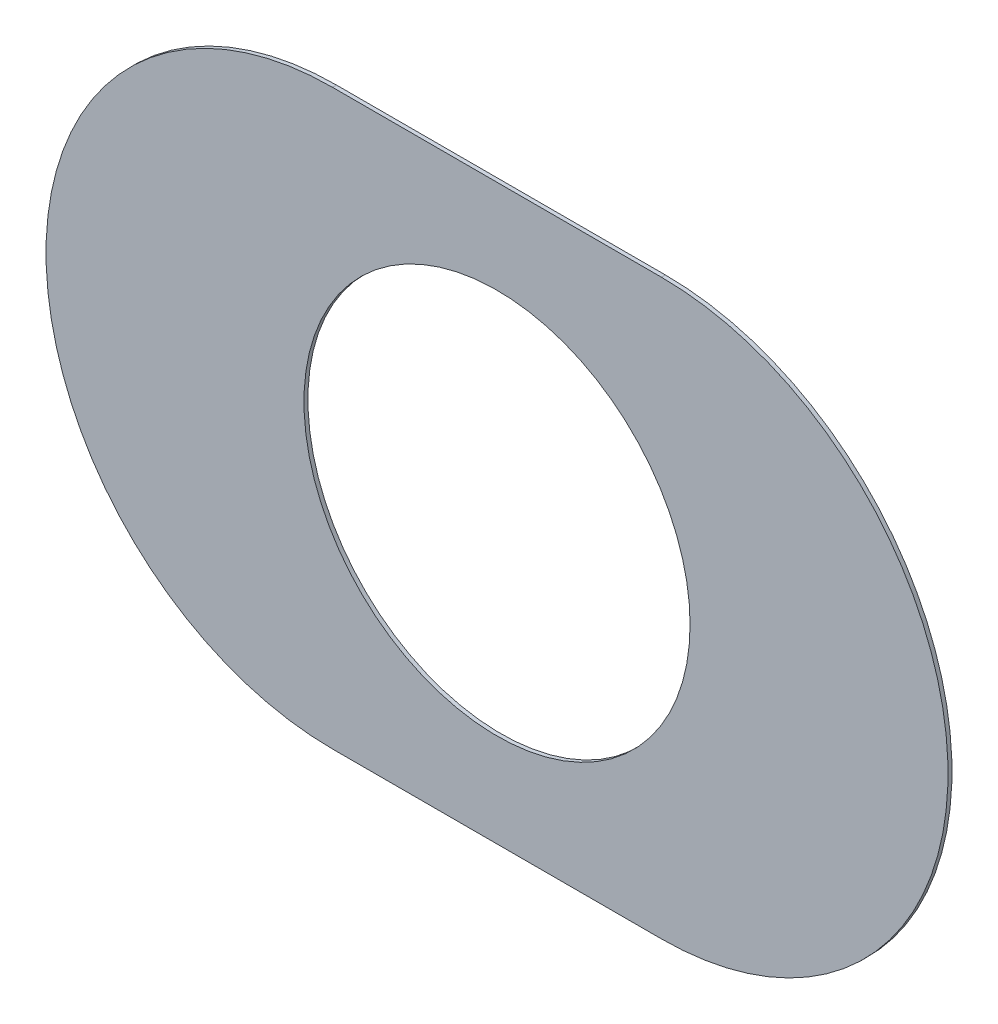
ISO-10303-21;
HEADER;
FILE_DESCRIPTION(('STEP AP214'),'2;1');
FILE_NAME('part.step','',(''),(''),'','','');
FILE_SCHEMA(('AUTOMOTIVE_DESIGN { 1 0 10303 214 1 1 1 1 }'));
ENDSEC;
DATA;
#1=APPLICATION_CONTEXT('core data for automotive mechanical design processes');
#2=APPLICATION_PROTOCOL_DEFINITION('international standard','automotive_design',2000,#1);
#3=PRODUCT_CONTEXT('',#1,'mechanical');
#4=PRODUCT('Part','Part','',(#3));
#5=PRODUCT_RELATED_PRODUCT_CATEGORY('part','',(#4));
#6=PRODUCT_DEFINITION_FORMATION('','',#4);
#7=PRODUCT_DEFINITION_CONTEXT('part definition',#1,'design');
#8=PRODUCT_DEFINITION('design','',#6,#7);
#9=PRODUCT_DEFINITION_SHAPE('','',#8);
#10=(LENGTH_UNIT() NAMED_UNIT(*) SI_UNIT(.MILLI.,.METRE.));
#11=(NAMED_UNIT(*) PLANE_ANGLE_UNIT() SI_UNIT($,.RADIAN.));
#12=(NAMED_UNIT(*) SI_UNIT($,.STERADIAN.) SOLID_ANGLE_UNIT());
#13=UNCERTAINTY_MEASURE_WITH_UNIT(LENGTH_MEASURE(1.E-05),#10,'distance_accuracy_value','');
#14=(GEOMETRIC_REPRESENTATION_CONTEXT(3) GLOBAL_UNCERTAINTY_ASSIGNED_CONTEXT((#13)) GLOBAL_UNIT_ASSIGNED_CONTEXT((#10,
#11,#12)) REPRESENTATION_CONTEXT('',''));
#15=CARTESIAN_POINT('',(0.,0.,0.));
#16=DIRECTION('',(0.,0.,1.));
#17=DIRECTION('',(1.,0.,0.));
#18=AXIS2_PLACEMENT_3D('',#15,#16,#17);
#19=CARTESIAN_POINT('',(24.3000003427268,22.1600006854535,0.));
#20=DIRECTION('',(0.,0.,1.));
#21=DIRECTION('',(1.,0.,0.));
#22=AXIS2_PLACEMENT_3D('',#19,#20,#21);
#23=PLANE('',#22);
#24=CARTESIAN_POINT('',(24.3000003427268,22.1600006854535,0.));
#25=DIRECTION('',(0.,0.,-1.));
#26=DIRECTION('',(-1.,0.,0.));
#27=AXIS2_PLACEMENT_3D('',#24,#25,#26);
#28=CIRCLE('',#27,0.49);
#29=CARTESIAN_POINT('',(24.7900003427268,22.1600006854535,0.));
#30=VERTEX_POINT('',#29);
#31=EDGE_CURVE('E129',#30,#30,#28,.T.);
#32=ORIENTED_EDGE('',*,*,#31,.T.);
#33=EDGE_LOOP('',(#32));
#34=FACE_BOUND('',#33,.T.);
#35=CARTESIAN_POINT('',(23.8825938881802,22.1600006854535,0.));
#36=DIRECTION('',(0.,0.,1.));
#37=DIRECTION('',(0.,1.,0.));
#38=AXIS2_PLACEMENT_3D('',#35,#36,#37);
#39=CIRCLE('',#38,0.727257121659981);
#40=CARTESIAN_POINT('',(23.8825938881802,22.8872578071135,0.));
#41=VERTEX_POINT('',#40);
#42=CARTESIAN_POINT('',(23.8825938881802,21.4327435637935,0.));
#43=VERTEX_POINT('',#42);
#44=EDGE_CURVE('E28',#41,#43,#39,.T.);
#45=ORIENTED_EDGE('',*,*,#44,.T.);
#46=DIRECTION('',(1.,0.,0.));
#47=VECTOR('',#46,1.);
#48=CARTESIAN_POINT('',(23.8825938881802,21.4327435637935,0.));
#49=LINE('',#48,#47);
#50=CARTESIAN_POINT('',(24.7174067972734,21.4327435637935,0.));
#51=VERTEX_POINT('',#50);
#52=EDGE_CURVE('E21',#43,#51,#49,.T.);
#53=ORIENTED_EDGE('',*,*,#52,.T.);
#54=CARTESIAN_POINT('',(24.7174067972734,22.1600006854535,0.));
#55=DIRECTION('',(0.,0.,1.));
#56=DIRECTION('',(0.,-1.,0.));
#57=AXIS2_PLACEMENT_3D('',#54,#55,#56);
#58=CIRCLE('',#57,0.727257121659981);
#59=CARTESIAN_POINT('',(24.7174067972734,22.8872578071135,0.));
#60=VERTEX_POINT('',#59);
#61=EDGE_CURVE('E99',#51,#60,#58,.T.);
#62=ORIENTED_EDGE('',*,*,#61,.T.);
#63=DIRECTION('',(-1.,0.,0.));
#64=VECTOR('',#63,1.);
#65=CARTESIAN_POINT('',(24.7174067972734,22.8872578071135,0.));
#66=LINE('',#65,#64);
#67=EDGE_CURVE('E123',#60,#41,#66,.T.);
#68=ORIENTED_EDGE('',*,*,#67,.T.);
#69=EDGE_LOOP('',(#45,#53,#62,#68));
#70=FACE_BOUND('',#69,.T.);
#71=ADVANCED_FACE('F17',(#34,#70),#23,.T.);
#72=CARTESIAN_POINT('',(24.3000003427268,22.1600006854535,-0.01));
#73=DIRECTION('',(0.,0.,1.));
#74=DIRECTION('',(1.,0.,0.));
#75=AXIS2_PLACEMENT_3D('',#72,#73,#74);
#76=PLANE('',#75);
#77=CARTESIAN_POINT('',(24.3000003427268,22.1600006854535,-0.01));
#78=DIRECTION('',(0.,0.,-1.));
#79=DIRECTION('',(-1.,0.,0.));
#80=AXIS2_PLACEMENT_3D('',#77,#78,#79);
#81=CIRCLE('',#80,0.49);
#82=CARTESIAN_POINT('',(24.7900003427268,22.1600006854535,-0.01));
#83=VERTEX_POINT('',#82);
#84=EDGE_CURVE('E112',#83,#83,#81,.T.);
#85=ORIENTED_EDGE('',*,*,#84,.F.);
#86=EDGE_LOOP('',(#85));
#87=FACE_BOUND('',#86,.T.);
#88=CARTESIAN_POINT('',(23.8825938881802,22.1600006854535,-0.01));
#89=DIRECTION('',(0.,0.,1.));
#90=DIRECTION('',(0.,1.,0.));
#91=AXIS2_PLACEMENT_3D('',#88,#89,#90);
#92=CIRCLE('',#91,0.727257121659981);
#93=CARTESIAN_POINT('',(23.8825938881802,22.8872578071135,-0.01));
#94=VERTEX_POINT('',#93);
#95=CARTESIAN_POINT('',(23.8825938881802,21.4327435637935,-0.01));
#96=VERTEX_POINT('',#95);
#97=EDGE_CURVE('E11',#94,#96,#92,.T.);
#98=ORIENTED_EDGE('',*,*,#97,.F.);
#99=DIRECTION('',(-1.,0.,0.));
#100=VECTOR('',#99,1.);
#101=CARTESIAN_POINT('',(24.7174067972734,22.8872578071135,-0.01));
#102=LINE('',#101,#100);
#103=CARTESIAN_POINT('',(24.7174067972734,22.8872578071135,-0.01));
#104=VERTEX_POINT('',#103);
#105=EDGE_CURVE('E92',#104,#94,#102,.T.);
#106=ORIENTED_EDGE('',*,*,#105,.F.);
#107=CARTESIAN_POINT('',(24.7174067972734,22.1600006854535,-0.01));
#108=DIRECTION('',(0.,0.,1.));
#109=DIRECTION('',(0.,-1.,0.));
#110=AXIS2_PLACEMENT_3D('',#107,#108,#109);
#111=CIRCLE('',#110,0.727257121659981);
#112=CARTESIAN_POINT('',(24.7174067972734,21.4327435637935,-0.01));
#113=VERTEX_POINT('',#112);
#114=EDGE_CURVE('E89',#113,#104,#111,.T.);
#115=ORIENTED_EDGE('',*,*,#114,.F.);
#116=DIRECTION('',(1.,0.,0.));
#117=VECTOR('',#116,1.);
#118=CARTESIAN_POINT('',(23.8825938881802,21.4327435637935,-0.01));
#119=LINE('',#118,#117);
#120=EDGE_CURVE('E80',#96,#113,#119,.T.);
#121=ORIENTED_EDGE('',*,*,#120,.F.);
#122=EDGE_LOOP('',(#98,#106,#115,#121));
#123=FACE_BOUND('',#122,.T.);
#124=ADVANCED_FACE('F90',(#87,#123),#76,.F.);
#125=CARTESIAN_POINT('',(23.8825938881802,22.1600006854535,0.));
#126=DIRECTION('',(0.,0.,1.));
#127=DIRECTION('',(0.,1.,0.));
#128=AXIS2_PLACEMENT_3D('',#125,#126,#127);
#129=CYLINDRICAL_SURFACE('',#128,0.727257121659981);
#130=ORIENTED_EDGE('',*,*,#44,.F.);
#131=DIRECTION('',(0.,0.,-1.));
#132=VECTOR('',#131,1.);
#133=CARTESIAN_POINT('',(23.8825938881802,22.8872578071135,0.));
#134=LINE('',#133,#132);
#135=EDGE_CURVE('E106',#41,#94,#134,.T.);
#136=ORIENTED_EDGE('',*,*,#135,.T.);
#137=ORIENTED_EDGE('',*,*,#97,.T.);
#138=DIRECTION('',(0.,0.,-1.));
#139=VECTOR('',#138,1.);
#140=CARTESIAN_POINT('',(23.8825938881802,21.4327435637935,0.));
#141=LINE('',#140,#139);
#142=EDGE_CURVE('E86',#43,#96,#141,.T.);
#143=ORIENTED_EDGE('',*,*,#142,.F.);
#144=EDGE_LOOP('',(#130,#136,#137,#143));
#145=FACE_BOUND('',#144,.T.);
#146=ADVANCED_FACE('F148',(#145),#129,.T.);
#147=CARTESIAN_POINT('',(23.8825938881802,21.4327435637935,0.));
#148=DIRECTION('',(0.,1.,0.));
#149=DIRECTION('',(1.,0.,0.));
#150=AXIS2_PLACEMENT_3D('',#147,#148,#149);
#151=PLANE('',#150);
#152=ORIENTED_EDGE('',*,*,#52,.F.);
#153=ORIENTED_EDGE('',*,*,#142,.T.);
#154=ORIENTED_EDGE('',*,*,#120,.T.);
#155=DIRECTION('',(0.,0.,-1.));
#156=VECTOR('',#155,1.);
#157=CARTESIAN_POINT('',(24.7174067972734,21.4327435637935,0.));
#158=LINE('',#157,#156);
#159=EDGE_CURVE('E84',#51,#113,#158,.T.);
#160=ORIENTED_EDGE('',*,*,#159,.F.);
#161=EDGE_LOOP('',(#152,#153,#154,#160));
#162=FACE_BOUND('',#161,.T.);
#163=ADVANCED_FACE('F82',(#162),#151,.F.);
#164=CARTESIAN_POINT('',(24.7174067972734,22.1600006854535,0.));
#165=DIRECTION('',(0.,0.,1.));
#166=DIRECTION('',(0.,-1.,0.));
#167=AXIS2_PLACEMENT_3D('',#164,#165,#166);
#168=CYLINDRICAL_SURFACE('',#167,0.727257121659981);
#169=ORIENTED_EDGE('',*,*,#61,.F.);
#170=ORIENTED_EDGE('',*,*,#159,.T.);
#171=ORIENTED_EDGE('',*,*,#114,.T.);
#172=DIRECTION('',(0.,0.,-1.));
#173=VECTOR('',#172,1.);
#174=CARTESIAN_POINT('',(24.7174067972734,22.8872578071135,0.));
#175=LINE('',#174,#173);
#176=EDGE_CURVE('E109',#60,#104,#175,.T.);
#177=ORIENTED_EDGE('',*,*,#176,.F.);
#178=EDGE_LOOP('',(#169,#170,#171,#177));
#179=FACE_BOUND('',#178,.T.);
#180=ADVANCED_FACE('F98',(#179),#168,.T.);
#181=CARTESIAN_POINT('',(24.7174067972734,22.8872578071135,0.));
#182=DIRECTION('',(0.,-1.,0.));
#183=DIRECTION('',(0.,0.,-1.));
#184=AXIS2_PLACEMENT_3D('',#181,#182,#183);
#185=PLANE('',#184);
#186=ORIENTED_EDGE('',*,*,#67,.F.);
#187=ORIENTED_EDGE('',*,*,#176,.T.);
#188=ORIENTED_EDGE('',*,*,#105,.T.);
#189=ORIENTED_EDGE('',*,*,#135,.F.);
#190=EDGE_LOOP('',(#186,#187,#188,#189));
#191=FACE_BOUND('',#190,.T.);
#192=ADVANCED_FACE('F19',(#191),#185,.F.);
#193=CARTESIAN_POINT('',(24.3000003427268,22.1600006854535,0.));
#194=DIRECTION('',(0.,0.,1.));
#195=DIRECTION('',(-1.,0.,0.));
#196=AXIS2_PLACEMENT_3D('',#193,#194,#195);
#197=CYLINDRICAL_SURFACE('',#196,0.49);
#198=ORIENTED_EDGE('',*,*,#84,.T.);
#199=DIRECTION('',(0.,0.,1.));
#200=VECTOR('',#199,1.);
#201=CARTESIAN_POINT('',(24.7900003427268,22.1600006854535,0.));
#202=LINE('',#201,#200);
#203=EDGE_CURVE('E115',#83,#30,#202,.T.);
#204=ORIENTED_EDGE('',*,*,#203,.T.);
#205=ORIENTED_EDGE('',*,*,#31,.F.);
#206=ORIENTED_EDGE('',*,*,#203,.F.);
#207=EDGE_LOOP('',(#198,#204,#205,#206));
#208=FACE_BOUND('',#207,.T.);
#209=ADVANCED_FACE('F189',(#208),#197,.F.);
#210=CLOSED_SHELL('',(#71,#124,#146,#163,#180,#192,#209));
#211=MANIFOLD_SOLID_BREP('B1',#210);
#212=ADVANCED_BREP_SHAPE_REPRESENTATION('',(#18,#211),#14);
#213=SHAPE_DEFINITION_REPRESENTATION(#9,#212);
ENDSEC;
END-ISO-10303-21;
